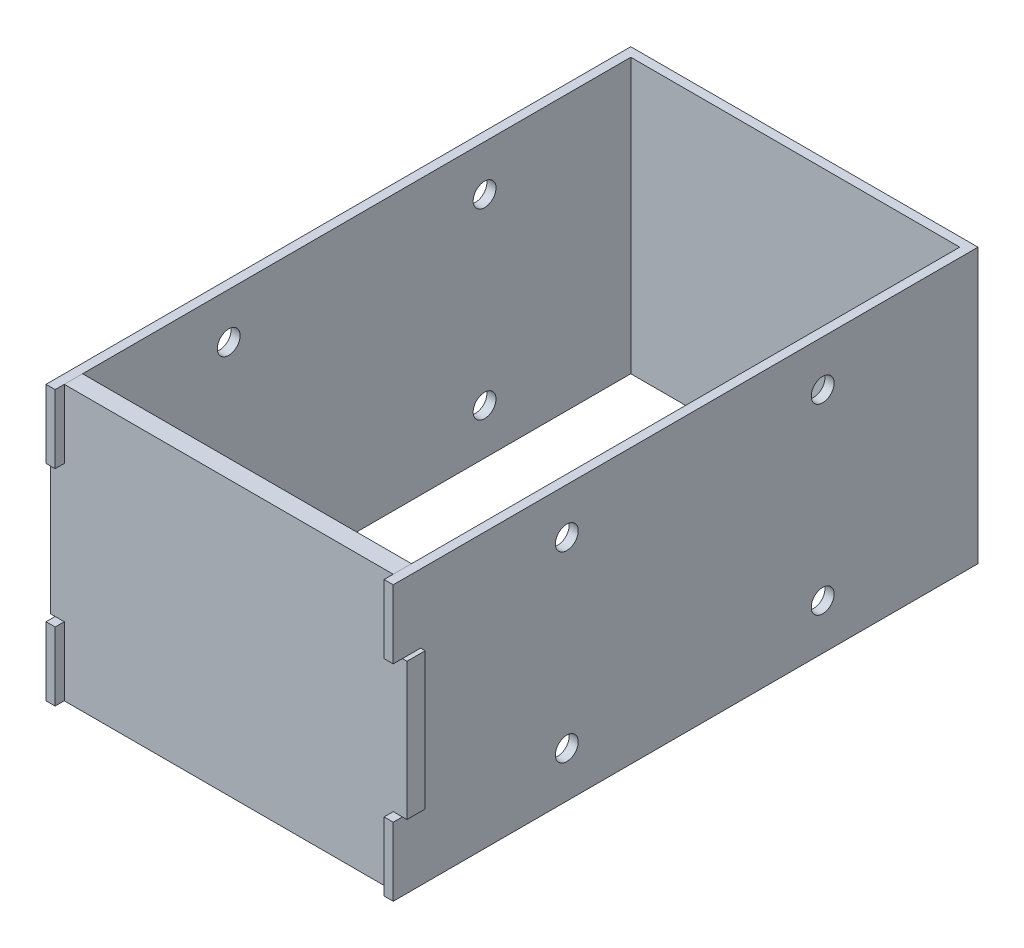
ISO-10303-21;
HEADER;
FILE_DESCRIPTION(('STEP AP214'),'2;1');
FILE_NAME('part.step','',(''),(''),'','','');
FILE_SCHEMA(('AUTOMOTIVE_DESIGN { 1 0 10303 214 1 1 1 1 }'));
ENDSEC;
DATA;
#1=APPLICATION_CONTEXT('core data for automotive mechanical design processes');
#2=APPLICATION_PROTOCOL_DEFINITION('international standard','automotive_design',2000,#1);
#3=PRODUCT_CONTEXT('',#1,'mechanical');
#4=PRODUCT('Part','Part','',(#3));
#5=PRODUCT_RELATED_PRODUCT_CATEGORY('part','',(#4));
#6=PRODUCT_DEFINITION_FORMATION('','',#4);
#7=PRODUCT_DEFINITION_CONTEXT('part definition',#1,'design');
#8=PRODUCT_DEFINITION('design','',#6,#7);
#9=PRODUCT_DEFINITION_SHAPE('','',#8);
#10=(LENGTH_UNIT() NAMED_UNIT(*) SI_UNIT(.MILLI.,.METRE.));
#11=(NAMED_UNIT(*) PLANE_ANGLE_UNIT() SI_UNIT($,.RADIAN.));
#12=(NAMED_UNIT(*) SI_UNIT($,.STERADIAN.) SOLID_ANGLE_UNIT());
#13=UNCERTAINTY_MEASURE_WITH_UNIT(LENGTH_MEASURE(1.E-05),#10,'distance_accuracy_value','');
#14=(GEOMETRIC_REPRESENTATION_CONTEXT(3) GLOBAL_UNCERTAINTY_ASSIGNED_CONTEXT((#13)) GLOBAL_UNIT_ASSIGNED_CONTEXT((#10,
#11,#12)) REPRESENTATION_CONTEXT('',''));
#15=CARTESIAN_POINT('',(0.,0.,0.));
#16=DIRECTION('',(0.,0.,1.));
#17=DIRECTION('',(1.,0.,0.));
#18=AXIS2_PLACEMENT_3D('',#15,#16,#17);
#19=CARTESIAN_POINT('',(1.,7.5,-1.));
#20=DIRECTION('',(1.,0.,0.));
#21=DIRECTION('',(0.,0.,-1.));
#22=AXIS2_PLACEMENT_3D('',#19,#20,#21);
#23=PLANE('',#22);
#24=DIRECTION('',(0.,-1.,0.));
#25=VECTOR('',#24,1.);
#26=CARTESIAN_POINT('',(1.,7.5,-3.));
#27=LINE('',#26,#25);
#28=CARTESIAN_POINT('',(1.,7.5,-3.));
#29=VERTEX_POINT('',#28);
#30=CARTESIAN_POINT('',(1.,0.,-3.));
#31=VERTEX_POINT('',#30);
#32=EDGE_CURVE('E169',#29,#31,#27,.T.);
#33=ORIENTED_EDGE('',*,*,#32,.T.);
#34=DIRECTION('',(0.,0.,-1.));
#35=VECTOR('',#34,1.);
#36=CARTESIAN_POINT('',(1.,0.,-1.));
#37=LINE('',#36,#35);
#38=CARTESIAN_POINT('',(1.,0.,-1.));
#39=VERTEX_POINT('',#38);
#40=EDGE_CURVE('E12',#39,#31,#37,.T.);
#41=ORIENTED_EDGE('',*,*,#40,.F.);
#42=DIRECTION('',(0.,-1.,0.));
#43=VECTOR('',#42,1.);
#44=CARTESIAN_POINT('',(1.,7.5,-1.));
#45=LINE('',#44,#43);
#46=CARTESIAN_POINT('',(1.,7.5,-1.));
#47=VERTEX_POINT('',#46);
#48=EDGE_CURVE('E191',#47,#39,#45,.T.);
#49=ORIENTED_EDGE('',*,*,#48,.F.);
#50=DIRECTION('',(0.,0.,-1.));
#51=VECTOR('',#50,1.);
#52=CARTESIAN_POINT('',(1.,7.5,-1.));
#53=LINE('',#52,#51);
#54=EDGE_CURVE('E165',#47,#29,#53,.T.);
#55=ORIENTED_EDGE('',*,*,#54,.T.);
#56=EDGE_LOOP('',(#33,#41,#49,#55));
#57=FACE_BOUND('',#56,.T.);
#58=ADVANCED_FACE('F49',(#57),#23,.F.);
#59=CARTESIAN_POINT('',(1.,0.,-1.));
#60=DIRECTION('',(0.,1.,0.));
#61=DIRECTION('',(0.,0.,1.));
#62=AXIS2_PLACEMENT_3D('',#59,#60,#61);
#63=PLANE('',#62);
#64=DIRECTION('',(1.,0.,0.));
#65=VECTOR('',#64,1.);
#66=CARTESIAN_POINT('',(1.,0.,-3.));
#67=LINE('',#66,#65);
#68=CARTESIAN_POINT('',(37.,0.,-3.));
#69=VERTEX_POINT('',#68);
#70=EDGE_CURVE('E172',#31,#69,#67,.T.);
#71=ORIENTED_EDGE('',*,*,#70,.T.);
#72=DIRECTION('',(0.,0.,-1.));
#73=VECTOR('',#72,1.);
#74=CARTESIAN_POINT('',(37.,0.,-1.));
#75=LINE('',#74,#73);
#76=CARTESIAN_POINT('',(37.,0.,-1.));
#77=VERTEX_POINT('',#76);
#78=EDGE_CURVE('E57',#77,#69,#75,.T.);
#79=ORIENTED_EDGE('',*,*,#78,.F.);
#80=DIRECTION('',(1.,0.,0.));
#81=VECTOR('',#80,1.);
#82=CARTESIAN_POINT('',(1.,0.,-1.));
#83=LINE('',#82,#81);
#84=EDGE_CURVE('E120',#39,#77,#83,.T.);
#85=ORIENTED_EDGE('',*,*,#84,.F.);
#86=ORIENTED_EDGE('',*,*,#40,.T.);
#87=EDGE_LOOP('',(#71,#79,#85,#86));
#88=FACE_BOUND('',#87,.T.);
#89=ADVANCED_FACE('F269',(#88),#63,.F.);
#90=CARTESIAN_POINT('',(37.,0.,-1.));
#91=DIRECTION('',(-1.,0.,0.));
#92=DIRECTION('',(0.,0.,1.));
#93=AXIS2_PLACEMENT_3D('',#90,#91,#92);
#94=PLANE('',#93);
#95=DIRECTION('',(0.,1.,0.));
#96=VECTOR('',#95,1.);
#97=CARTESIAN_POINT('',(37.,0.,-3.));
#98=LINE('',#97,#96);
#99=CARTESIAN_POINT('',(37.,7.5,-3.));
#100=VERTEX_POINT('',#99);
#101=EDGE_CURVE('E174',#69,#100,#98,.T.);
#102=ORIENTED_EDGE('',*,*,#101,.T.);
#103=DIRECTION('',(0.,0.,-1.));
#104=VECTOR('',#103,1.);
#105=CARTESIAN_POINT('',(37.,7.5,-1.));
#106=LINE('',#105,#104);
#107=CARTESIAN_POINT('',(37.,7.5,-1.));
#108=VERTEX_POINT('',#107);
#109=EDGE_CURVE('E210',#108,#100,#106,.T.);
#110=ORIENTED_EDGE('',*,*,#109,.F.);
#111=DIRECTION('',(0.,1.,0.));
#112=VECTOR('',#111,1.);
#113=CARTESIAN_POINT('',(37.,0.,-1.));
#114=LINE('',#113,#112);
#115=EDGE_CURVE('E218',#77,#108,#114,.T.);
#116=ORIENTED_EDGE('',*,*,#115,.F.);
#117=ORIENTED_EDGE('',*,*,#78,.T.);
#118=EDGE_LOOP('',(#102,#110,#116,#117));
#119=FACE_BOUND('',#118,.T.);
#120=ADVANCED_FACE('F216',(#119),#94,.F.);
#121=CARTESIAN_POINT('',(38.5,7.5,-1.));
#122=DIRECTION('',(0.,1.,0.));
#123=DIRECTION('',(-1.,0.,0.));
#124=AXIS2_PLACEMENT_3D('',#121,#122,#123);
#125=PLANE('',#124);
#126=DIRECTION('',(1.,0.,0.));
#127=VECTOR('',#126,1.);
#128=CARTESIAN_POINT('',(38.5,7.5,-3.));
#129=LINE('',#128,#127);
#130=CARTESIAN_POINT('',(38.5,7.5,-3.));
#131=VERTEX_POINT('',#130);
#132=EDGE_CURVE('E176',#100,#131,#129,.T.);
#133=ORIENTED_EDGE('',*,*,#132,.T.);
#134=DIRECTION('',(0.,0.,-1.));
#135=VECTOR('',#134,1.);
#136=CARTESIAN_POINT('',(38.5,7.5,-1.));
#137=LINE('',#136,#135);
#138=CARTESIAN_POINT('',(38.5,7.5,-1.));
#139=VERTEX_POINT('',#138);
#140=EDGE_CURVE('E207',#139,#131,#137,.T.);
#141=ORIENTED_EDGE('',*,*,#140,.F.);
#142=DIRECTION('',(1.,0.,0.));
#143=VECTOR('',#142,1.);
#144=CARTESIAN_POINT('',(38.5,7.5,-1.));
#145=LINE('',#144,#143);
#146=EDGE_CURVE('E236',#108,#139,#145,.T.);
#147=ORIENTED_EDGE('',*,*,#146,.F.);
#148=ORIENTED_EDGE('',*,*,#109,.T.);
#149=EDGE_LOOP('',(#133,#141,#147,#148));
#150=FACE_BOUND('',#149,.T.);
#151=ADVANCED_FACE('F227',(#150),#125,.F.);
#152=CARTESIAN_POINT('',(38.5,22.5,-1.));
#153=DIRECTION('',(-1.,0.,0.));
#154=DIRECTION('',(0.,0.,1.));
#155=AXIS2_PLACEMENT_3D('',#152,#153,#154);
#156=PLANE('',#155);
#157=DIRECTION('',(0.,1.,0.));
#158=VECTOR('',#157,1.);
#159=CARTESIAN_POINT('',(38.5,22.5,-3.));
#160=LINE('',#159,#158);
#161=CARTESIAN_POINT('',(38.5,22.5,-3.));
#162=VERTEX_POINT('',#161);
#163=EDGE_CURVE('E178',#131,#162,#160,.T.);
#164=ORIENTED_EDGE('',*,*,#163,.T.);
#165=DIRECTION('',(0.,0.,-1.));
#166=VECTOR('',#165,1.);
#167=CARTESIAN_POINT('',(38.5,22.5,-1.));
#168=LINE('',#167,#166);
#169=CARTESIAN_POINT('',(38.5,22.5,-1.));
#170=VERTEX_POINT('',#169);
#171=EDGE_CURVE('E204',#170,#162,#168,.T.);
#172=ORIENTED_EDGE('',*,*,#171,.F.);
#173=DIRECTION('',(0.,1.,0.));
#174=VECTOR('',#173,1.);
#175=CARTESIAN_POINT('',(38.5,22.5,-1.));
#176=LINE('',#175,#174);
#177=EDGE_CURVE('E233',#139,#170,#176,.T.);
#178=ORIENTED_EDGE('',*,*,#177,.F.);
#179=ORIENTED_EDGE('',*,*,#140,.T.);
#180=EDGE_LOOP('',(#164,#172,#178,#179));
#181=FACE_BOUND('',#180,.T.);
#182=ADVANCED_FACE('F231',(#181),#156,.F.);
#183=CARTESIAN_POINT('',(37.,22.5,-1.));
#184=DIRECTION('',(0.,-1.,0.));
#185=DIRECTION('',(1.,0.,0.));
#186=AXIS2_PLACEMENT_3D('',#183,#184,#185);
#187=PLANE('',#186);
#188=DIRECTION('',(-1.,0.,0.));
#189=VECTOR('',#188,1.);
#190=CARTESIAN_POINT('',(37.,22.5,-3.));
#191=LINE('',#190,#189);
#192=CARTESIAN_POINT('',(37.,22.5,-3.));
#193=VERTEX_POINT('',#192);
#194=EDGE_CURVE('E180',#162,#193,#191,.T.);
#195=ORIENTED_EDGE('',*,*,#194,.T.);
#196=DIRECTION('',(0.,0.,-1.));
#197=VECTOR('',#196,1.);
#198=CARTESIAN_POINT('',(37.,22.5,-1.));
#199=LINE('',#198,#197);
#200=CARTESIAN_POINT('',(37.,22.5,-1.));
#201=VERTEX_POINT('',#200);
#202=EDGE_CURVE('E201',#201,#193,#199,.T.);
#203=ORIENTED_EDGE('',*,*,#202,.F.);
#204=DIRECTION('',(-1.,0.,0.));
#205=VECTOR('',#204,1.);
#206=CARTESIAN_POINT('',(37.,22.5,-1.));
#207=LINE('',#206,#205);
#208=EDGE_CURVE('E235',#170,#201,#207,.T.);
#209=ORIENTED_EDGE('',*,*,#208,.F.);
#210=ORIENTED_EDGE('',*,*,#171,.T.);
#211=EDGE_LOOP('',(#195,#203,#209,#210));
#212=FACE_BOUND('',#211,.T.);
#213=ADVANCED_FACE('F282',(#212),#187,.F.);
#214=CARTESIAN_POINT('',(37.,22.5,-1.));
#215=DIRECTION('',(-1.,0.,0.));
#216=DIRECTION('',(0.,0.,1.));
#217=AXIS2_PLACEMENT_3D('',#214,#215,#216);
#218=PLANE('',#217);
#219=DIRECTION('',(0.,1.,0.));
#220=VECTOR('',#219,1.);
#221=CARTESIAN_POINT('',(37.,22.5,-3.));
#222=LINE('',#221,#220);
#223=CARTESIAN_POINT('',(37.,30.,-3.));
#224=VERTEX_POINT('',#223);
#225=EDGE_CURVE('E182',#193,#224,#222,.T.);
#226=ORIENTED_EDGE('',*,*,#225,.T.);
#227=DIRECTION('',(0.,0.,-1.));
#228=VECTOR('',#227,1.);
#229=CARTESIAN_POINT('',(37.,30.,-1.));
#230=LINE('',#229,#228);
#231=CARTESIAN_POINT('',(37.,30.,-1.));
#232=VERTEX_POINT('',#231);
#233=EDGE_CURVE('E198',#232,#224,#230,.T.);
#234=ORIENTED_EDGE('',*,*,#233,.F.);
#235=DIRECTION('',(0.,1.,0.));
#236=VECTOR('',#235,1.);
#237=CARTESIAN_POINT('',(37.,22.5,-1.));
#238=LINE('',#237,#236);
#239=EDGE_CURVE('E238',#201,#232,#238,.T.);
#240=ORIENTED_EDGE('',*,*,#239,.F.);
#241=ORIENTED_EDGE('',*,*,#202,.T.);
#242=EDGE_LOOP('',(#226,#234,#240,#241));
#243=FACE_BOUND('',#242,.T.);
#244=ADVANCED_FACE('F285',(#243),#218,.F.);
#245=CARTESIAN_POINT('',(37.,30.,-1.));
#246=DIRECTION('',(0.,-1.,0.));
#247=DIRECTION('',(0.,0.,-1.));
#248=AXIS2_PLACEMENT_3D('',#245,#246,#247);
#249=PLANE('',#248);
#250=DIRECTION('',(-1.,0.,0.));
#251=VECTOR('',#250,1.);
#252=CARTESIAN_POINT('',(37.,30.,-3.));
#253=LINE('',#252,#251);
#254=CARTESIAN_POINT('',(1.,30.,-3.));
#255=VERTEX_POINT('',#254);
#256=EDGE_CURVE('E184',#224,#255,#253,.T.);
#257=ORIENTED_EDGE('',*,*,#256,.T.);
#258=DIRECTION('',(0.,0.,-1.));
#259=VECTOR('',#258,1.);
#260=CARTESIAN_POINT('',(1.,30.,-1.));
#261=LINE('',#260,#259);
#262=CARTESIAN_POINT('',(1.,30.,-1.));
#263=VERTEX_POINT('',#262);
#264=EDGE_CURVE('E195',#263,#255,#261,.T.);
#265=ORIENTED_EDGE('',*,*,#264,.F.);
#266=DIRECTION('',(-1.,0.,0.));
#267=VECTOR('',#266,1.);
#268=CARTESIAN_POINT('',(37.,30.,-1.));
#269=LINE('',#268,#267);
#270=EDGE_CURVE('E244',#232,#263,#269,.T.);
#271=ORIENTED_EDGE('',*,*,#270,.F.);
#272=ORIENTED_EDGE('',*,*,#233,.T.);
#273=EDGE_LOOP('',(#257,#265,#271,#272));
#274=FACE_BOUND('',#273,.T.);
#275=ADVANCED_FACE('F250',(#274),#249,.F.);
#276=CARTESIAN_POINT('',(1.,30.,-1.));
#277=DIRECTION('',(1.,0.,0.));
#278=DIRECTION('',(0.,1.,0.));
#279=AXIS2_PLACEMENT_3D('',#276,#277,#278);
#280=PLANE('',#279);
#281=DIRECTION('',(0.,-1.,0.));
#282=VECTOR('',#281,1.);
#283=CARTESIAN_POINT('',(1.,30.,-3.));
#284=LINE('',#283,#282);
#285=CARTESIAN_POINT('',(1.,22.5,-3.));
#286=VERTEX_POINT('',#285);
#287=EDGE_CURVE('E186',#255,#286,#284,.T.);
#288=ORIENTED_EDGE('',*,*,#287,.T.);
#289=DIRECTION('',(0.,0.,-1.));
#290=VECTOR('',#289,1.);
#291=CARTESIAN_POINT('',(1.,22.5,-1.));
#292=LINE('',#291,#290);
#293=CARTESIAN_POINT('',(1.,22.5,-1.));
#294=VERTEX_POINT('',#293);
#295=EDGE_CURVE('E160',#294,#286,#292,.T.);
#296=ORIENTED_EDGE('',*,*,#295,.F.);
#297=DIRECTION('',(0.,-1.,0.));
#298=VECTOR('',#297,1.);
#299=CARTESIAN_POINT('',(1.,30.,-1.));
#300=LINE('',#299,#298);
#301=EDGE_CURVE('E151',#263,#294,#300,.T.);
#302=ORIENTED_EDGE('',*,*,#301,.F.);
#303=ORIENTED_EDGE('',*,*,#264,.T.);
#304=EDGE_LOOP('',(#288,#296,#302,#303));
#305=FACE_BOUND('',#304,.T.);
#306=ADVANCED_FACE('F254',(#305),#280,.F.);
#307=CARTESIAN_POINT('',(1.,22.5,-1.));
#308=DIRECTION('',(0.,-1.,0.));
#309=DIRECTION('',(0.,0.,-1.));
#310=AXIS2_PLACEMENT_3D('',#307,#308,#309);
#311=PLANE('',#310);
#312=DIRECTION('',(-1.,0.,0.));
#313=VECTOR('',#312,1.);
#314=CARTESIAN_POINT('',(1.,22.5,-3.));
#315=LINE('',#314,#313);
#316=CARTESIAN_POINT('',(-0.499999999999999,22.5,-3.));
#317=VERTEX_POINT('',#316);
#318=EDGE_CURVE('E159',#286,#317,#315,.T.);
#319=ORIENTED_EDGE('',*,*,#318,.T.);
#320=DIRECTION('',(0.,0.,-1.));
#321=VECTOR('',#320,1.);
#322=CARTESIAN_POINT('',(-0.499999999999999,22.5,-1.));
#323=LINE('',#322,#321);
#324=CARTESIAN_POINT('',(-0.499999999999999,22.5,-1.));
#325=VERTEX_POINT('',#324);
#326=EDGE_CURVE('E156',#325,#317,#323,.T.);
#327=ORIENTED_EDGE('',*,*,#326,.F.);
#328=DIRECTION('',(-1.,0.,0.));
#329=VECTOR('',#328,1.);
#330=CARTESIAN_POINT('',(1.,22.5,-1.));
#331=LINE('',#330,#329);
#332=EDGE_CURVE('E145',#294,#325,#331,.T.);
#333=ORIENTED_EDGE('',*,*,#332,.F.);
#334=ORIENTED_EDGE('',*,*,#295,.T.);
#335=EDGE_LOOP('',(#319,#327,#333,#334));
#336=FACE_BOUND('',#335,.T.);
#337=ADVANCED_FACE('F157',(#336),#311,.F.);
#338=CARTESIAN_POINT('',(-0.499999999999999,22.5,-1.));
#339=DIRECTION('',(1.,0.,0.));
#340=DIRECTION('',(0.,1.,0.));
#341=AXIS2_PLACEMENT_3D('',#338,#339,#340);
#342=PLANE('',#341);
#343=DIRECTION('',(0.,-1.,0.));
#344=VECTOR('',#343,1.);
#345=CARTESIAN_POINT('',(-0.499999999999999,22.5,-3.));
#346=LINE('',#345,#344);
#347=CARTESIAN_POINT('',(-0.499999999999997,7.5,-3.));
#348=VERTEX_POINT('',#347);
#349=EDGE_CURVE('E106',#317,#348,#346,.T.);
#350=ORIENTED_EDGE('',*,*,#349,.T.);
#351=DIRECTION('',(0.,0.,-1.));
#352=VECTOR('',#351,1.);
#353=CARTESIAN_POINT('',(-0.499999999999997,7.5,-1.));
#354=LINE('',#353,#352);
#355=CARTESIAN_POINT('',(-0.499999999999997,7.5,-1.));
#356=VERTEX_POINT('',#355);
#357=EDGE_CURVE('E161',#356,#348,#354,.T.);
#358=ORIENTED_EDGE('',*,*,#357,.F.);
#359=DIRECTION('',(0.,-1.,0.));
#360=VECTOR('',#359,1.);
#361=CARTESIAN_POINT('',(-0.499999999999999,22.5,-1.));
#362=LINE('',#361,#360);
#363=EDGE_CURVE('E149',#325,#356,#362,.T.);
#364=ORIENTED_EDGE('',*,*,#363,.F.);
#365=ORIENTED_EDGE('',*,*,#326,.T.);
#366=EDGE_LOOP('',(#350,#358,#364,#365));
#367=FACE_BOUND('',#366,.T.);
#368=ADVANCED_FACE('F163',(#367),#342,.F.);
#369=CARTESIAN_POINT('',(-0.499999999999997,7.5,-1.));
#370=DIRECTION('',(0.,1.,0.));
#371=DIRECTION('',(0.,0.,1.));
#372=AXIS2_PLACEMENT_3D('',#369,#370,#371);
#373=PLANE('',#372);
#374=DIRECTION('',(1.,0.,0.));
#375=VECTOR('',#374,1.);
#376=CARTESIAN_POINT('',(-0.499999999999997,7.5,-3.));
#377=LINE('',#376,#375);
#378=EDGE_CURVE('E112',#348,#29,#377,.T.);
#379=ORIENTED_EDGE('',*,*,#378,.T.);
#380=ORIENTED_EDGE('',*,*,#54,.F.);
#381=DIRECTION('',(1.,0.,0.));
#382=VECTOR('',#381,1.);
#383=CARTESIAN_POINT('',(-0.499999999999997,7.5,-1.));
#384=LINE('',#383,#382);
#385=EDGE_CURVE('E65',#356,#47,#384,.T.);
#386=ORIENTED_EDGE('',*,*,#385,.F.);
#387=ORIENTED_EDGE('',*,*,#357,.T.);
#388=EDGE_LOOP('',(#379,#380,#386,#387));
#389=FACE_BOUND('',#388,.T.);
#390=ADVANCED_FACE('F258',(#389),#373,.F.);
#391=CARTESIAN_POINT('',(0.,0.,-1.));
#392=DIRECTION('',(0.,0.,1.));
#393=DIRECTION('',(1.,0.,0.));
#394=AXIS2_PLACEMENT_3D('',#391,#392,#393);
#395=PLANE('',#394);
#396=ORIENTED_EDGE('',*,*,#48,.T.);
#397=ORIENTED_EDGE('',*,*,#84,.T.);
#398=ORIENTED_EDGE('',*,*,#115,.T.);
#399=ORIENTED_EDGE('',*,*,#146,.T.);
#400=ORIENTED_EDGE('',*,*,#177,.T.);
#401=ORIENTED_EDGE('',*,*,#208,.T.);
#402=ORIENTED_EDGE('',*,*,#239,.T.);
#403=ORIENTED_EDGE('',*,*,#270,.T.);
#404=ORIENTED_EDGE('',*,*,#301,.T.);
#405=ORIENTED_EDGE('',*,*,#332,.T.);
#406=ORIENTED_EDGE('',*,*,#363,.T.);
#407=ORIENTED_EDGE('',*,*,#385,.T.);
#408=EDGE_LOOP('',(#396,#397,#398,#399,#400,#401,#402,#403,#404,#405,#406,#407));
#409=FACE_BOUND('',#408,.T.);
#410=ADVANCED_FACE('F147',(#409),#395,.T.);
#411=CARTESIAN_POINT('',(0.,0.,-3.));
#412=DIRECTION('',(0.,0.,1.));
#413=DIRECTION('',(1.,0.,0.));
#414=AXIS2_PLACEMENT_3D('',#411,#412,#413);
#415=PLANE('',#414);
#416=ORIENTED_EDGE('',*,*,#32,.F.);
#417=ORIENTED_EDGE('',*,*,#378,.F.);
#418=ORIENTED_EDGE('',*,*,#349,.F.);
#419=ORIENTED_EDGE('',*,*,#318,.F.);
#420=ORIENTED_EDGE('',*,*,#287,.F.);
#421=ORIENTED_EDGE('',*,*,#256,.F.);
#422=ORIENTED_EDGE('',*,*,#225,.F.);
#423=ORIENTED_EDGE('',*,*,#194,.F.);
#424=ORIENTED_EDGE('',*,*,#163,.F.);
#425=ORIENTED_EDGE('',*,*,#132,.F.);
#426=ORIENTED_EDGE('',*,*,#101,.F.);
#427=ORIENTED_EDGE('',*,*,#70,.F.);
#428=EDGE_LOOP('',(#416,#417,#418,#419,#420,#421,#422,#423,#424,#425,#426,#427));
#429=FACE_BOUND('',#428,.T.);
#430=ADVANCED_FACE('F222',(#429),#415,.F.);
#431=CLOSED_SHELL('',(#58,#89,#120,#151,#182,#213,#244,#275,#306,#337,#368,#390,#410,#430));
#432=MANIFOLD_SOLID_BREP('B2',#431);
#433=CARTESIAN_POINT('',(0.,30.,0.));
#434=DIRECTION('',(0.,0.,-1.));
#435=DIRECTION('',(-1.,0.,0.));
#436=AXIS2_PLACEMENT_3D('',#433,#434,#435);
#437=PLANE('',#436);
#438=DIRECTION('',(0.,-1.,0.));
#439=VECTOR('',#438,1.);
#440=CARTESIAN_POINT('',(1.,30.,0.));
#441=LINE('',#440,#439);
#442=CARTESIAN_POINT('',(1.,7.5,0.));
#443=VERTEX_POINT('',#442);
#444=CARTESIAN_POINT('',(1.,0.,0.));
#445=VERTEX_POINT('',#444);
#446=EDGE_CURVE('E644',#443,#445,#441,.T.);
#447=ORIENTED_EDGE('',*,*,#446,.F.);
#448=DIRECTION('',(1.,0.,0.));
#449=VECTOR('',#448,1.);
#450=CARTESIAN_POINT('',(38.,7.5,0.));
#451=LINE('',#450,#449);
#452=CARTESIAN_POINT('',(0.,7.5,0.));
#453=VERTEX_POINT('',#452);
#454=EDGE_CURVE('E508',#453,#443,#451,.T.);
#455=ORIENTED_EDGE('',*,*,#454,.F.);
#456=DIRECTION('',(0.,-1.,0.));
#457=VECTOR('',#456,1.);
#458=CARTESIAN_POINT('',(0.,30.,0.));
#459=LINE('',#458,#457);
#460=CARTESIAN_POINT('',(0.,0.,0.));
#461=VERTEX_POINT('',#460);
#462=EDGE_CURVE('E604',#453,#461,#459,.T.);
#463=ORIENTED_EDGE('',*,*,#462,.T.);
#464=DIRECTION('',(1.,0.,0.));
#465=VECTOR('',#464,1.);
#466=CARTESIAN_POINT('',(0.,0.,0.));
#467=LINE('',#466,#465);
#468=EDGE_CURVE('E585',#461,#445,#467,.T.);
#469=ORIENTED_EDGE('',*,*,#468,.T.);
#470=EDGE_LOOP('',(#447,#455,#463,#469));
#471=FACE_BOUND('',#470,.T.);
#472=ADVANCED_FACE('F380',(#471),#437,.F.);
#473=CARTESIAN_POINT('',(38.,30.,0.));
#474=DIRECTION('',(0.,0.,-1.));
#475=DIRECTION('',(-1.,0.,0.));
#476=AXIS2_PLACEMENT_3D('',#473,#474,#475);
#477=PLANE('',#476);
#478=DIRECTION('',(0.,-1.,0.));
#479=VECTOR('',#478,1.);
#480=CARTESIAN_POINT('',(38.,30.,0.));
#481=LINE('',#480,#479);
#482=CARTESIAN_POINT('',(38.,7.5,0.));
#483=VERTEX_POINT('',#482);
#484=CARTESIAN_POINT('',(38.,0.,0.));
#485=VERTEX_POINT('',#484);
#486=EDGE_CURVE('E632',#483,#485,#481,.T.);
#487=ORIENTED_EDGE('',*,*,#486,.F.);
#488=DIRECTION('',(-1.,0.,0.));
#489=VECTOR('',#488,1.);
#490=CARTESIAN_POINT('',(38.,7.5,0.));
#491=LINE('',#490,#489);
#492=CARTESIAN_POINT('',(37.,7.5,0.));
#493=VERTEX_POINT('',#492);
#494=EDGE_CURVE('E388',#483,#493,#491,.T.);
#495=ORIENTED_EDGE('',*,*,#494,.T.);
#496=DIRECTION('',(0.,-1.,0.));
#497=VECTOR('',#496,1.);
#498=CARTESIAN_POINT('',(37.,30.,0.));
#499=LINE('',#498,#497);
#500=CARTESIAN_POINT('',(37.,0.,0.));
#501=VERTEX_POINT('',#500);
#502=EDGE_CURVE('E634',#493,#501,#499,.T.);
#503=ORIENTED_EDGE('',*,*,#502,.T.);
#504=DIRECTION('',(1.,0.,0.));
#505=VECTOR('',#504,1.);
#506=CARTESIAN_POINT('',(38.,0.,0.));
#507=LINE('',#506,#505);
#508=EDGE_CURVE('E614',#501,#485,#507,.T.);
#509=ORIENTED_EDGE('',*,*,#508,.T.);
#510=EDGE_LOOP('',(#487,#495,#503,#509));
#511=FACE_BOUND('',#510,.T.);
#512=ADVANCED_FACE('F651',(#511),#477,.F.);
#513=CARTESIAN_POINT('',(38.,30.,-64.));
#514=DIRECTION('',(-1.,0.,0.));
#515=DIRECTION('',(0.,0.,1.));
#516=AXIS2_PLACEMENT_3D('',#513,#514,#515);
#517=PLANE('',#516);
#518=CARTESIAN_POINT('',(38.,5.,-47.));
#519=DIRECTION('',(1.,0.,0.));
#520=DIRECTION('',(0.,0.,-1.));
#521=AXIS2_PLACEMENT_3D('',#518,#519,#520);
#522=CIRCLE('',#521,1.25);
#523=CARTESIAN_POINT('',(38.,5.,-48.25));
#524=VERTEX_POINT('',#523);
#525=EDGE_CURVE('E537',#524,#524,#522,.T.);
#526=ORIENTED_EDGE('',*,*,#525,.F.);
#527=EDGE_LOOP('',(#526));
#528=FACE_BOUND('',#527,.T.);
#529=DIRECTION('',(0.,1.,0.));
#530=VECTOR('',#529,1.);
#531=CARTESIAN_POINT('',(38.,7.5,-3.));
#532=LINE('',#531,#530);
#533=CARTESIAN_POINT('',(38.,7.5,-3.));
#534=VERTEX_POINT('',#533);
#535=CARTESIAN_POINT('',(38.,22.5,-3.));
#536=VERTEX_POINT('',#535);
#537=EDGE_CURVE('E501',#534,#536,#532,.T.);
#538=ORIENTED_EDGE('',*,*,#537,.F.);
#539=DIRECTION('',(0.,0.,1.));
#540=VECTOR('',#539,1.);
#541=CARTESIAN_POINT('',(38.,7.5,-3.));
#542=LINE('',#541,#540);
#543=EDGE_CURVE('E526',#534,#483,#542,.T.);
#544=ORIENTED_EDGE('',*,*,#543,.T.);
#545=ORIENTED_EDGE('',*,*,#486,.T.);
#546=DIRECTION('',(0.,0.,-1.));
#547=VECTOR('',#546,1.);
#548=CARTESIAN_POINT('',(38.,0.,-64.));
#549=LINE('',#548,#547);
#550=CARTESIAN_POINT('',(38.,0.,-64.));
#551=VERTEX_POINT('',#550);
#552=EDGE_CURVE('E617',#485,#551,#549,.T.);
#553=ORIENTED_EDGE('',*,*,#552,.T.);
#554=DIRECTION('',(0.,-1.,0.));
#555=VECTOR('',#554,1.);
#556=CARTESIAN_POINT('',(38.,30.,-64.));
#557=LINE('',#556,#555);
#558=CARTESIAN_POINT('',(38.,30.,-64.));
#559=VERTEX_POINT('',#558);
#560=EDGE_CURVE('E629',#559,#551,#557,.T.);
#561=ORIENTED_EDGE('',*,*,#560,.F.);
#562=DIRECTION('',(0.,0.,-1.));
#563=VECTOR('',#562,1.);
#564=CARTESIAN_POINT('',(38.,30.,-64.));
#565=LINE('',#564,#563);
#566=CARTESIAN_POINT('',(38.,30.,0.));
#567=VERTEX_POINT('',#566);
#568=EDGE_CURVE('E598',#567,#559,#565,.T.);
#569=ORIENTED_EDGE('',*,*,#568,.F.);
#570=CARTESIAN_POINT('',(38.,22.5,0.));
#571=VERTEX_POINT('',#570);
#572=EDGE_CURVE('E515',#567,#571,#481,.T.);
#573=ORIENTED_EDGE('',*,*,#572,.T.);
#574=DIRECTION('',(0.,0.,1.));
#575=VECTOR('',#574,1.);
#576=CARTESIAN_POINT('',(38.,22.5,-3.));
#577=LINE('',#576,#575);
#578=EDGE_CURVE('E403',#536,#571,#577,.T.);
#579=ORIENTED_EDGE('',*,*,#578,.F.);
#580=EDGE_LOOP('',(#538,#544,#545,#553,#561,#569,#573,#579));
#581=FACE_BOUND('',#580,.T.);
#582=CARTESIAN_POINT('',(38.,5.,-19.));
#583=DIRECTION('',(1.,0.,0.));
#584=DIRECTION('',(0.,0.,-1.));
#585=AXIS2_PLACEMENT_3D('',#582,#583,#584);
#586=CIRCLE('',#585,1.25);
#587=CARTESIAN_POINT('',(38.,5.,-20.25));
#588=VERTEX_POINT('',#587);
#589=EDGE_CURVE('E555',#588,#588,#586,.T.);
#590=ORIENTED_EDGE('',*,*,#589,.F.);
#591=EDGE_LOOP('',(#590));
#592=FACE_BOUND('',#591,.T.);
#593=CARTESIAN_POINT('',(38.,25.,-19.));
#594=DIRECTION('',(1.,0.,0.));
#595=DIRECTION('',(0.,0.,-1.));
#596=AXIS2_PLACEMENT_3D('',#593,#594,#595);
#597=CIRCLE('',#596,1.25);
#598=CARTESIAN_POINT('',(38.,25.,-20.25));
#599=VERTEX_POINT('',#598);
#600=EDGE_CURVE('E549',#599,#599,#597,.T.);
#601=ORIENTED_EDGE('',*,*,#600,.F.);
#602=EDGE_LOOP('',(#601));
#603=FACE_BOUND('',#602,.T.);
#604=CARTESIAN_POINT('',(38.,25.,-47.));
#605=DIRECTION('',(1.,0.,0.));
#606=DIRECTION('',(0.,0.,-1.));
#607=AXIS2_PLACEMENT_3D('',#604,#605,#606);
#608=CIRCLE('',#607,1.25);
#609=CARTESIAN_POINT('',(38.,25.,-48.25));
#610=VERTEX_POINT('',#609);
#611=EDGE_CURVE('E543',#610,#610,#608,.T.);
#612=ORIENTED_EDGE('',*,*,#611,.F.);
#613=EDGE_LOOP('',(#612));
#614=FACE_BOUND('',#613,.T.);
#615=ADVANCED_FACE('F511',(#528,#581,#592,#603,#614),#517,.F.);
#616=CARTESIAN_POINT('',(0.,30.,0.));
#617=DIRECTION('',(1.,0.,0.));
#618=DIRECTION('',(0.,0.,-1.));
#619=AXIS2_PLACEMENT_3D('',#616,#617,#618);
#620=PLANE('',#619);
#621=ORIENTED_EDGE('',*,*,#462,.F.);
#622=DIRECTION('',(0.,0.,1.));
#623=VECTOR('',#622,1.);
#624=CARTESIAN_POINT('',(0.,7.5,-3.));
#625=LINE('',#624,#623);
#626=CARTESIAN_POINT('',(0.,7.5,-3.));
#627=VERTEX_POINT('',#626);
#628=EDGE_CURVE('E519',#627,#453,#625,.T.);
#629=ORIENTED_EDGE('',*,*,#628,.F.);
#630=DIRECTION('',(0.,-1.,0.));
#631=VECTOR('',#630,1.);
#632=CARTESIAN_POINT('',(0.,7.5,-3.));
#633=LINE('',#632,#631);
#634=CARTESIAN_POINT('',(0.,22.5,-3.));
#635=VERTEX_POINT('',#634);
#636=EDGE_CURVE('E497',#635,#627,#633,.T.);
#637=ORIENTED_EDGE('',*,*,#636,.F.);
#638=DIRECTION('',(0.,0.,1.));
#639=VECTOR('',#638,1.);
#640=CARTESIAN_POINT('',(0.,22.5,-3.));
#641=LINE('',#640,#639);
#642=CARTESIAN_POINT('',(0.,22.5,0.));
#643=VERTEX_POINT('',#642);
#644=EDGE_CURVE('E516',#635,#643,#641,.T.);
#645=ORIENTED_EDGE('',*,*,#644,.T.);
#646=CARTESIAN_POINT('',(0.,30.,0.));
#647=VERTEX_POINT('',#646);
#648=EDGE_CURVE('E623',#647,#643,#459,.T.);
#649=ORIENTED_EDGE('',*,*,#648,.F.);
#650=DIRECTION('',(0.,0.,1.));
#651=VECTOR('',#650,1.);
#652=CARTESIAN_POINT('',(0.,30.,0.));
#653=LINE('',#652,#651);
#654=CARTESIAN_POINT('',(0.,30.,-64.));
#655=VERTEX_POINT('',#654);
#656=EDGE_CURVE('E602',#655,#647,#653,.T.);
#657=ORIENTED_EDGE('',*,*,#656,.F.);
#658=DIRECTION('',(0.,-1.,0.));
#659=VECTOR('',#658,1.);
#660=CARTESIAN_POINT('',(0.,30.,-64.));
#661=LINE('',#660,#659);
#662=CARTESIAN_POINT('',(0.,0.,-64.));
#663=VERTEX_POINT('',#662);
#664=EDGE_CURVE('E626',#655,#663,#661,.T.);
#665=ORIENTED_EDGE('',*,*,#664,.T.);
#666=DIRECTION('',(0.,0.,1.));
#667=VECTOR('',#666,1.);
#668=CARTESIAN_POINT('',(0.,0.,0.));
#669=LINE('',#668,#667);
#670=EDGE_CURVE('E590',#663,#461,#669,.T.);
#671=ORIENTED_EDGE('',*,*,#670,.T.);
#672=EDGE_LOOP('',(#621,#629,#637,#645,#649,#657,#665,#671));
#673=FACE_BOUND('',#672,.T.);
#674=CARTESIAN_POINT('',(0.,5.,-47.));
#675=DIRECTION('',(-1.,0.,0.));
#676=DIRECTION('',(0.,0.,1.));
#677=AXIS2_PLACEMENT_3D('',#674,#675,#676);
#678=CIRCLE('',#677,1.25);
#679=CARTESIAN_POINT('',(0.,5.,-45.75));
#680=VERTEX_POINT('',#679);
#681=EDGE_CURVE('E561',#680,#680,#678,.T.);
#682=ORIENTED_EDGE('',*,*,#681,.F.);
#683=EDGE_LOOP('',(#682));
#684=FACE_BOUND('',#683,.T.);
#685=CARTESIAN_POINT('',(0.,25.,-47.));
#686=DIRECTION('',(-1.,0.,0.));
#687=DIRECTION('',(0.,0.,1.));
#688=AXIS2_PLACEMENT_3D('',#685,#686,#687);
#689=CIRCLE('',#688,1.25);
#690=CARTESIAN_POINT('',(0.,25.,-45.75));
#691=VERTEX_POINT('',#690);
#692=EDGE_CURVE('E567',#691,#691,#689,.T.);
#693=ORIENTED_EDGE('',*,*,#692,.F.);
#694=EDGE_LOOP('',(#693));
#695=FACE_BOUND('',#694,.T.);
#696=CARTESIAN_POINT('',(0.,25.,-19.));
#697=DIRECTION('',(-1.,0.,0.));
#698=DIRECTION('',(0.,0.,1.));
#699=AXIS2_PLACEMENT_3D('',#696,#697,#698);
#700=CIRCLE('',#699,1.25);
#701=CARTESIAN_POINT('',(0.,25.,-17.75));
#702=VERTEX_POINT('',#701);
#703=EDGE_CURVE('E573',#702,#702,#700,.T.);
#704=ORIENTED_EDGE('',*,*,#703,.F.);
#705=EDGE_LOOP('',(#704));
#706=FACE_BOUND('',#705,.T.);
#707=CARTESIAN_POINT('',(0.,5.,-19.));
#708=DIRECTION('',(-1.,0.,0.));
#709=DIRECTION('',(0.,0.,1.));
#710=AXIS2_PLACEMENT_3D('',#707,#708,#709);
#711=CIRCLE('',#710,1.25);
#712=CARTESIAN_POINT('',(0.,5.,-17.75));
#713=VERTEX_POINT('',#712);
#714=EDGE_CURVE('E579',#713,#713,#711,.T.);
#715=ORIENTED_EDGE('',*,*,#714,.F.);
#716=EDGE_LOOP('',(#715));
#717=FACE_BOUND('',#716,.T.);
#718=ADVANCED_FACE('F695',(#673,#684,#695,#706,#717),#620,.F.);
#719=ORIENTED_EDGE('',*,*,#648,.T.);
#720=DIRECTION('',(-1.,0.,0.));
#721=VECTOR('',#720,1.);
#722=CARTESIAN_POINT('',(38.,22.5,0.));
#723=LINE('',#722,#721);
#724=CARTESIAN_POINT('',(1.,22.5,0.));
#725=VERTEX_POINT('',#724);
#726=EDGE_CURVE('E681',#725,#643,#723,.T.);
#727=ORIENTED_EDGE('',*,*,#726,.F.);
#728=CARTESIAN_POINT('',(1.,30.,0.));
#729=VERTEX_POINT('',#728);
#730=EDGE_CURVE('E645',#729,#725,#441,.T.);
#731=ORIENTED_EDGE('',*,*,#730,.F.);
#732=DIRECTION('',(1.,0.,0.));
#733=VECTOR('',#732,1.);
#734=CARTESIAN_POINT('',(0.,30.,0.));
#735=LINE('',#734,#733);
#736=EDGE_CURVE('E586',#647,#729,#735,.T.);
#737=ORIENTED_EDGE('',*,*,#736,.F.);
#738=EDGE_LOOP('',(#719,#727,#731,#737));
#739=FACE_BOUND('',#738,.T.);
#740=ADVANCED_FACE('F382',(#739),#437,.F.);
#741=CARTESIAN_POINT('',(1.,30.,0.));
#742=DIRECTION('',(-1.,0.,0.));
#743=DIRECTION('',(0.,0.,1.));
#744=AXIS2_PLACEMENT_3D('',#741,#742,#743);
#745=PLANE('',#744);
#746=CARTESIAN_POINT('',(1.,5.,-47.));
#747=DIRECTION('',(-1.,0.,0.));
#748=DIRECTION('',(0.,0.,1.));
#749=AXIS2_PLACEMENT_3D('',#746,#747,#748);
#750=CIRCLE('',#749,1.25);
#751=CARTESIAN_POINT('',(1.,5.,-45.75));
#752=VERTEX_POINT('',#751);
#753=EDGE_CURVE('E564',#752,#752,#750,.T.);
#754=ORIENTED_EDGE('',*,*,#753,.T.);
#755=EDGE_LOOP('',(#754));
#756=FACE_BOUND('',#755,.T.);
#757=CARTESIAN_POINT('',(1.,25.,-47.));
#758=DIRECTION('',(-1.,0.,0.));
#759=DIRECTION('',(0.,0.,1.));
#760=AXIS2_PLACEMENT_3D('',#757,#758,#759);
#761=CIRCLE('',#760,1.25);
#762=CARTESIAN_POINT('',(1.,25.,-45.75));
#763=VERTEX_POINT('',#762);
#764=EDGE_CURVE('E570',#763,#763,#761,.T.);
#765=ORIENTED_EDGE('',*,*,#764,.T.);
#766=EDGE_LOOP('',(#765));
#767=FACE_BOUND('',#766,.T.);
#768=CARTESIAN_POINT('',(1.,25.,-19.));
#769=DIRECTION('',(-1.,0.,0.));
#770=DIRECTION('',(0.,0.,1.));
#771=AXIS2_PLACEMENT_3D('',#768,#769,#770);
#772=CIRCLE('',#771,1.25);
#773=CARTESIAN_POINT('',(1.,25.,-17.75));
#774=VERTEX_POINT('',#773);
#775=EDGE_CURVE('E576',#774,#774,#772,.T.);
#776=ORIENTED_EDGE('',*,*,#775,.T.);
#777=EDGE_LOOP('',(#776));
#778=FACE_BOUND('',#777,.T.);
#779=CARTESIAN_POINT('',(1.,5.,-19.));
#780=DIRECTION('',(-1.,0.,0.));
#781=DIRECTION('',(0.,0.,1.));
#782=AXIS2_PLACEMENT_3D('',#779,#780,#781);
#783=CIRCLE('',#782,1.25);
#784=CARTESIAN_POINT('',(1.,5.,-17.75));
#785=VERTEX_POINT('',#784);
#786=EDGE_CURVE('E582',#785,#785,#783,.T.);
#787=ORIENTED_EDGE('',*,*,#786,.T.);
#788=EDGE_LOOP('',(#787));
#789=FACE_BOUND('',#788,.T.);
#790=DIRECTION('',(0.,1.,0.));
#791=VECTOR('',#790,1.);
#792=CARTESIAN_POINT('',(1.,30.,-3.));
#793=LINE('',#792,#791);
#794=CARTESIAN_POINT('',(1.,7.5,-3.));
#795=VERTEX_POINT('',#794);
#796=CARTESIAN_POINT('',(1.,22.5,-3.));
#797=VERTEX_POINT('',#796);
#798=EDGE_CURVE('E535',#795,#797,#793,.T.);
#799=ORIENTED_EDGE('',*,*,#798,.F.);
#800=DIRECTION('',(0.,0.,1.));
#801=VECTOR('',#800,1.);
#802=CARTESIAN_POINT('',(1.,7.5,0.));
#803=LINE('',#802,#801);
#804=EDGE_CURVE('E532',#795,#443,#803,.T.);
#805=ORIENTED_EDGE('',*,*,#804,.T.);
#806=ORIENTED_EDGE('',*,*,#446,.T.);
#807=DIRECTION('',(0.,0.,-1.));
#808=VECTOR('',#807,1.);
#809=CARTESIAN_POINT('',(1.,0.,0.));
#810=LINE('',#809,#808);
#811=CARTESIAN_POINT('',(1.,0.,-63.));
#812=VERTEX_POINT('',#811);
#813=EDGE_CURVE('E607',#445,#812,#810,.T.);
#814=ORIENTED_EDGE('',*,*,#813,.T.);
#815=DIRECTION('',(0.,-1.,0.));
#816=VECTOR('',#815,1.);
#817=CARTESIAN_POINT('',(1.,30.,-63.));
#818=LINE('',#817,#816);
#819=CARTESIAN_POINT('',(1.,30.,-63.));
#820=VERTEX_POINT('',#819);
#821=EDGE_CURVE('E641',#820,#812,#818,.T.);
#822=ORIENTED_EDGE('',*,*,#821,.F.);
#823=DIRECTION('',(0.,0.,-1.));
#824=VECTOR('',#823,1.);
#825=CARTESIAN_POINT('',(1.,30.,0.));
#826=LINE('',#825,#824);
#827=EDGE_CURVE('E589',#729,#820,#826,.T.);
#828=ORIENTED_EDGE('',*,*,#827,.F.);
#829=ORIENTED_EDGE('',*,*,#730,.T.);
#830=DIRECTION('',(0.,0.,-1.));
#831=VECTOR('',#830,1.);
#832=CARTESIAN_POINT('',(1.,22.5,0.));
#833=LINE('',#832,#831);
#834=EDGE_CURVE('E525',#725,#797,#833,.T.);
#835=ORIENTED_EDGE('',*,*,#834,.T.);
#836=EDGE_LOOP('',(#799,#805,#806,#814,#822,#828,#829,#835));
#837=FACE_BOUND('',#836,.T.);
#838=ADVANCED_FACE('F701',(#756,#767,#778,#789,#837),#745,.F.);
#839=CARTESIAN_POINT('',(1.,30.,-63.));
#840=DIRECTION('',(0.,0.,-1.));
#841=DIRECTION('',(-1.,0.,0.));
#842=AXIS2_PLACEMENT_3D('',#839,#840,#841);
#843=PLANE('',#842);
#844=DIRECTION('',(1.,0.,0.));
#845=VECTOR('',#844,1.);
#846=CARTESIAN_POINT('',(1.,0.,-63.));
#847=LINE('',#846,#845);
#848=CARTESIAN_POINT('',(37.,0.,-63.));
#849=VERTEX_POINT('',#848);
#850=EDGE_CURVE('E609',#812,#849,#847,.T.);
#851=ORIENTED_EDGE('',*,*,#850,.T.);
#852=DIRECTION('',(0.,-1.,0.));
#853=VECTOR('',#852,1.);
#854=CARTESIAN_POINT('',(37.,30.,-63.));
#855=LINE('',#854,#853);
#856=CARTESIAN_POINT('',(37.,30.,-63.));
#857=VERTEX_POINT('',#856);
#858=EDGE_CURVE('E638',#857,#849,#855,.T.);
#859=ORIENTED_EDGE('',*,*,#858,.F.);
#860=DIRECTION('',(1.,0.,0.));
#861=VECTOR('',#860,1.);
#862=CARTESIAN_POINT('',(1.,30.,-63.));
#863=LINE('',#862,#861);
#864=EDGE_CURVE('E592',#820,#857,#863,.T.);
#865=ORIENTED_EDGE('',*,*,#864,.F.);
#866=ORIENTED_EDGE('',*,*,#821,.T.);
#867=EDGE_LOOP('',(#851,#859,#865,#866));
#868=FACE_BOUND('',#867,.T.);
#869=ADVANCED_FACE('F704',(#868),#843,.F.);
#870=CARTESIAN_POINT('',(37.,30.,-63.));
#871=DIRECTION('',(1.,0.,0.));
#872=DIRECTION('',(0.,0.,-1.));
#873=AXIS2_PLACEMENT_3D('',#870,#871,#872);
#874=PLANE('',#873);
#875=ORIENTED_EDGE('',*,*,#502,.F.);
#876=DIRECTION('',(0.,0.,-1.));
#877=VECTOR('',#876,1.);
#878=CARTESIAN_POINT('',(37.,7.5,-63.));
#879=LINE('',#878,#877);
#880=CARTESIAN_POINT('',(37.,7.5,-3.));
#881=VERTEX_POINT('',#880);
#882=EDGE_CURVE('E529',#493,#881,#879,.T.);
#883=ORIENTED_EDGE('',*,*,#882,.T.);
#884=DIRECTION('',(0.,-1.,0.));
#885=VECTOR('',#884,1.);
#886=CARTESIAN_POINT('',(37.,30.,-3.));
#887=LINE('',#886,#885);
#888=CARTESIAN_POINT('',(37.,22.5,-3.));
#889=VERTEX_POINT('',#888);
#890=EDGE_CURVE('E47',#889,#881,#887,.T.);
#891=ORIENTED_EDGE('',*,*,#890,.F.);
#892=DIRECTION('',(0.,0.,1.));
#893=VECTOR('',#892,1.);
#894=CARTESIAN_POINT('',(37.,22.5,-63.));
#895=LINE('',#894,#893);
#896=CARTESIAN_POINT('',(37.,22.5,0.));
#897=VERTEX_POINT('',#896);
#898=EDGE_CURVE('E494',#889,#897,#895,.T.);
#899=ORIENTED_EDGE('',*,*,#898,.T.);
#900=CARTESIAN_POINT('',(37.,30.,0.));
#901=VERTEX_POINT('',#900);
#902=EDGE_CURVE('E635',#901,#897,#499,.T.);
#903=ORIENTED_EDGE('',*,*,#902,.F.);
#904=DIRECTION('',(0.,0.,1.));
#905=VECTOR('',#904,1.);
#906=CARTESIAN_POINT('',(37.,30.,-63.));
#907=LINE('',#906,#905);
#908=EDGE_CURVE('E594',#857,#901,#907,.T.);
#909=ORIENTED_EDGE('',*,*,#908,.F.);
#910=ORIENTED_EDGE('',*,*,#858,.T.);
#911=DIRECTION('',(0.,0.,1.));
#912=VECTOR('',#911,1.);
#913=CARTESIAN_POINT('',(37.,0.,-63.));
#914=LINE('',#913,#912);
#915=EDGE_CURVE('E611',#849,#501,#914,.T.);
#916=ORIENTED_EDGE('',*,*,#915,.T.);
#917=EDGE_LOOP('',(#875,#883,#891,#899,#903,#909,#910,#916));
#918=FACE_BOUND('',#917,.T.);
#919=CARTESIAN_POINT('',(37.,5.,-47.));
#920=DIRECTION('',(1.,0.,0.));
#921=DIRECTION('',(0.,0.,-1.));
#922=AXIS2_PLACEMENT_3D('',#919,#920,#921);
#923=CIRCLE('',#922,1.25);
#924=CARTESIAN_POINT('',(37.,5.,-48.25));
#925=VERTEX_POINT('',#924);
#926=EDGE_CURVE('E540',#925,#925,#923,.T.);
#927=ORIENTED_EDGE('',*,*,#926,.T.);
#928=EDGE_LOOP('',(#927));
#929=FACE_BOUND('',#928,.T.);
#930=CARTESIAN_POINT('',(37.,25.,-47.));
#931=DIRECTION('',(1.,0.,0.));
#932=DIRECTION('',(0.,0.,-1.));
#933=AXIS2_PLACEMENT_3D('',#930,#931,#932);
#934=CIRCLE('',#933,1.25);
#935=CARTESIAN_POINT('',(37.,25.,-48.25));
#936=VERTEX_POINT('',#935);
#937=EDGE_CURVE('E546',#936,#936,#934,.T.);
#938=ORIENTED_EDGE('',*,*,#937,.T.);
#939=EDGE_LOOP('',(#938));
#940=FACE_BOUND('',#939,.T.);
#941=CARTESIAN_POINT('',(37.,25.,-19.));
#942=DIRECTION('',(1.,0.,0.));
#943=DIRECTION('',(0.,0.,-1.));
#944=AXIS2_PLACEMENT_3D('',#941,#942,#943);
#945=CIRCLE('',#944,1.25);
#946=CARTESIAN_POINT('',(37.,25.,-20.25));
#947=VERTEX_POINT('',#946);
#948=EDGE_CURVE('E552',#947,#947,#945,.T.);
#949=ORIENTED_EDGE('',*,*,#948,.T.);
#950=EDGE_LOOP('',(#949));
#951=FACE_BOUND('',#950,.T.);
#952=CARTESIAN_POINT('',(37.,5.,-19.));
#953=DIRECTION('',(1.,0.,0.));
#954=DIRECTION('',(0.,0.,-1.));
#955=AXIS2_PLACEMENT_3D('',#952,#953,#954);
#956=CIRCLE('',#955,1.25);
#957=CARTESIAN_POINT('',(37.,5.,-20.25));
#958=VERTEX_POINT('',#957);
#959=EDGE_CURVE('E558',#958,#958,#956,.T.);
#960=ORIENTED_EDGE('',*,*,#959,.T.);
#961=EDGE_LOOP('',(#960));
#962=FACE_BOUND('',#961,.T.);
#963=ADVANCED_FACE('F654',(#918,#929,#940,#951,#962),#874,.F.);
#964=ORIENTED_EDGE('',*,*,#902,.T.);
#965=EDGE_CURVE('E680',#571,#897,#723,.T.);
#966=ORIENTED_EDGE('',*,*,#965,.F.);
#967=ORIENTED_EDGE('',*,*,#572,.F.);
#968=DIRECTION('',(1.,0.,0.));
#969=VECTOR('',#968,1.);
#970=CARTESIAN_POINT('',(38.,30.,0.));
#971=LINE('',#970,#969);
#972=EDGE_CURVE('E596',#901,#567,#971,.T.);
#973=ORIENTED_EDGE('',*,*,#972,.F.);
#974=EDGE_LOOP('',(#964,#966,#967,#973));
#975=FACE_BOUND('',#974,.T.);
#976=ADVANCED_FACE('F679',(#975),#477,.F.);
#977=CARTESIAN_POINT('',(0.,30.,-64.));
#978=DIRECTION('',(0.,0.,1.));
#979=DIRECTION('',(1.,0.,0.));
#980=AXIS2_PLACEMENT_3D('',#977,#978,#979);
#981=PLANE('',#980);
#982=DIRECTION('',(-1.,0.,0.));
#983=VECTOR('',#982,1.);
#984=CARTESIAN_POINT('',(0.,0.,-64.));
#985=LINE('',#984,#983);
#986=EDGE_CURVE('E619',#551,#663,#985,.T.);
#987=ORIENTED_EDGE('',*,*,#986,.T.);
#988=ORIENTED_EDGE('',*,*,#664,.F.);
#989=DIRECTION('',(-1.,0.,0.));
#990=VECTOR('',#989,1.);
#991=CARTESIAN_POINT('',(0.,30.,-64.));
#992=LINE('',#991,#990);
#993=EDGE_CURVE('E600',#559,#655,#992,.T.);
#994=ORIENTED_EDGE('',*,*,#993,.F.);
#995=ORIENTED_EDGE('',*,*,#560,.T.);
#996=EDGE_LOOP('',(#987,#988,#994,#995));
#997=FACE_BOUND('',#996,.T.);
#998=ADVANCED_FACE('F670',(#997),#981,.F.);
#999=CARTESIAN_POINT('',(0.,30.,0.));
#1000=DIRECTION('',(0.,1.,0.));
#1001=DIRECTION('',(0.,0.,1.));
#1002=AXIS2_PLACEMENT_3D('',#999,#1000,#1001);
#1003=PLANE('',#1002);
#1004=ORIENTED_EDGE('',*,*,#736,.T.);
#1005=ORIENTED_EDGE('',*,*,#827,.T.);
#1006=ORIENTED_EDGE('',*,*,#864,.T.);
#1007=ORIENTED_EDGE('',*,*,#908,.T.);
#1008=ORIENTED_EDGE('',*,*,#972,.T.);
#1009=ORIENTED_EDGE('',*,*,#568,.T.);
#1010=ORIENTED_EDGE('',*,*,#993,.T.);
#1011=ORIENTED_EDGE('',*,*,#656,.T.);
#1012=EDGE_LOOP('',(#1004,#1005,#1006,#1007,#1008,#1009,#1010,#1011));
#1013=FACE_BOUND('',#1012,.T.);
#1014=ADVANCED_FACE('F674',(#1013),#1003,.T.);
#1015=CARTESIAN_POINT('',(0.,0.,0.));
#1016=DIRECTION('',(0.,1.,0.));
#1017=DIRECTION('',(0.,0.,1.));
#1018=AXIS2_PLACEMENT_3D('',#1015,#1016,#1017);
#1019=PLANE('',#1018);
#1020=ORIENTED_EDGE('',*,*,#468,.F.);
#1021=ORIENTED_EDGE('',*,*,#670,.F.);
#1022=ORIENTED_EDGE('',*,*,#986,.F.);
#1023=ORIENTED_EDGE('',*,*,#552,.F.);
#1024=ORIENTED_EDGE('',*,*,#508,.F.);
#1025=ORIENTED_EDGE('',*,*,#915,.F.);
#1026=ORIENTED_EDGE('',*,*,#850,.F.);
#1027=ORIENTED_EDGE('',*,*,#813,.F.);
#1028=EDGE_LOOP('',(#1020,#1021,#1022,#1023,#1024,#1025,#1026,#1027));
#1029=FACE_BOUND('',#1028,.T.);
#1030=ADVANCED_FACE('F664',(#1029),#1019,.F.);
#1031=CARTESIAN_POINT('',(0.,5.,-19.));
#1032=DIRECTION('',(-1.,0.,0.));
#1033=DIRECTION('',(0.,0.,1.));
#1034=AXIS2_PLACEMENT_3D('',#1031,#1032,#1033);
#1035=CYLINDRICAL_SURFACE('',#1034,1.25);
#1036=ORIENTED_EDGE('',*,*,#786,.F.);
#1037=EDGE_LOOP('',(#1036));
#1038=FACE_BOUND('',#1037,.T.);
#1039=ORIENTED_EDGE('',*,*,#714,.T.);
#1040=EDGE_LOOP('',(#1039));
#1041=FACE_BOUND('',#1040,.T.);
#1042=ADVANCED_FACE('F782',(#1038,#1041),#1035,.F.);
#1043=CARTESIAN_POINT('',(0.,25.,-19.));
#1044=DIRECTION('',(-1.,0.,0.));
#1045=DIRECTION('',(0.,0.,1.));
#1046=AXIS2_PLACEMENT_3D('',#1043,#1044,#1045);
#1047=CYLINDRICAL_SURFACE('',#1046,1.25);
#1048=ORIENTED_EDGE('',*,*,#775,.F.);
#1049=EDGE_LOOP('',(#1048));
#1050=FACE_BOUND('',#1049,.T.);
#1051=ORIENTED_EDGE('',*,*,#703,.T.);
#1052=EDGE_LOOP('',(#1051));
#1053=FACE_BOUND('',#1052,.T.);
#1054=ADVANCED_FACE('F789',(#1050,#1053),#1047,.F.);
#1055=CARTESIAN_POINT('',(0.,25.,-47.));
#1056=DIRECTION('',(-1.,0.,0.));
#1057=DIRECTION('',(0.,0.,1.));
#1058=AXIS2_PLACEMENT_3D('',#1055,#1056,#1057);
#1059=CYLINDRICAL_SURFACE('',#1058,1.25);
#1060=ORIENTED_EDGE('',*,*,#764,.F.);
#1061=EDGE_LOOP('',(#1060));
#1062=FACE_BOUND('',#1061,.T.);
#1063=ORIENTED_EDGE('',*,*,#692,.T.);
#1064=EDGE_LOOP('',(#1063));
#1065=FACE_BOUND('',#1064,.T.);
#1066=ADVANCED_FACE('F796',(#1062,#1065),#1059,.F.);
#1067=CARTESIAN_POINT('',(0.,5.,-47.));
#1068=DIRECTION('',(-1.,0.,0.));
#1069=DIRECTION('',(0.,0.,1.));
#1070=AXIS2_PLACEMENT_3D('',#1067,#1068,#1069);
#1071=CYLINDRICAL_SURFACE('',#1070,1.25);
#1072=ORIENTED_EDGE('',*,*,#753,.F.);
#1073=EDGE_LOOP('',(#1072));
#1074=FACE_BOUND('',#1073,.T.);
#1075=ORIENTED_EDGE('',*,*,#681,.T.);
#1076=EDGE_LOOP('',(#1075));
#1077=FACE_BOUND('',#1076,.T.);
#1078=ADVANCED_FACE('F804',(#1074,#1077),#1071,.F.);
#1079=CARTESIAN_POINT('',(38.,5.,-19.));
#1080=DIRECTION('',(1.,0.,0.));
#1081=DIRECTION('',(0.,0.,-1.));
#1082=AXIS2_PLACEMENT_3D('',#1079,#1080,#1081);
#1083=CYLINDRICAL_SURFACE('',#1082,1.25);
#1084=ORIENTED_EDGE('',*,*,#959,.F.);
#1085=EDGE_LOOP('',(#1084));
#1086=FACE_BOUND('',#1085,.T.);
#1087=ORIENTED_EDGE('',*,*,#589,.T.);
#1088=EDGE_LOOP('',(#1087));
#1089=FACE_BOUND('',#1088,.T.);
#1090=ADVANCED_FACE('F812',(#1086,#1089),#1083,.F.);
#1091=CARTESIAN_POINT('',(38.,25.,-19.));
#1092=DIRECTION('',(1.,0.,0.));
#1093=DIRECTION('',(0.,0.,-1.));
#1094=AXIS2_PLACEMENT_3D('',#1091,#1092,#1093);
#1095=CYLINDRICAL_SURFACE('',#1094,1.25);
#1096=ORIENTED_EDGE('',*,*,#948,.F.);
#1097=EDGE_LOOP('',(#1096));
#1098=FACE_BOUND('',#1097,.T.);
#1099=ORIENTED_EDGE('',*,*,#600,.T.);
#1100=EDGE_LOOP('',(#1099));
#1101=FACE_BOUND('',#1100,.T.);
#1102=ADVANCED_FACE('F820',(#1098,#1101),#1095,.F.);
#1103=CARTESIAN_POINT('',(38.,25.,-47.));
#1104=DIRECTION('',(1.,0.,0.));
#1105=DIRECTION('',(0.,0.,-1.));
#1106=AXIS2_PLACEMENT_3D('',#1103,#1104,#1105);
#1107=CYLINDRICAL_SURFACE('',#1106,1.25);
#1108=ORIENTED_EDGE('',*,*,#937,.F.);
#1109=EDGE_LOOP('',(#1108));
#1110=FACE_BOUND('',#1109,.T.);
#1111=ORIENTED_EDGE('',*,*,#611,.T.);
#1112=EDGE_LOOP('',(#1111));
#1113=FACE_BOUND('',#1112,.T.);
#1114=ADVANCED_FACE('F828',(#1110,#1113),#1107,.F.);
#1115=CARTESIAN_POINT('',(38.,5.,-47.));
#1116=DIRECTION('',(1.,0.,0.));
#1117=DIRECTION('',(0.,0.,-1.));
#1118=AXIS2_PLACEMENT_3D('',#1115,#1116,#1117);
#1119=CYLINDRICAL_SURFACE('',#1118,1.25);
#1120=ORIENTED_EDGE('',*,*,#926,.F.);
#1121=EDGE_LOOP('',(#1120));
#1122=FACE_BOUND('',#1121,.T.);
#1123=ORIENTED_EDGE('',*,*,#525,.T.);
#1124=EDGE_LOOP('',(#1123));
#1125=FACE_BOUND('',#1124,.T.);
#1126=ADVANCED_FACE('F836',(#1122,#1125),#1119,.F.);
#1127=CARTESIAN_POINT('',(38.,7.5,-3.));
#1128=DIRECTION('',(0.,-1.,0.));
#1129=DIRECTION('',(1.,0.,0.));
#1130=AXIS2_PLACEMENT_3D('',#1127,#1128,#1129);
#1131=PLANE('',#1130);
#1132=ORIENTED_EDGE('',*,*,#494,.F.);
#1133=ORIENTED_EDGE('',*,*,#543,.F.);
#1134=DIRECTION('',(1.,0.,0.));
#1135=VECTOR('',#1134,1.);
#1136=CARTESIAN_POINT('',(38.,7.5,-3.));
#1137=LINE('',#1136,#1135);
#1138=EDGE_CURVE('E504',#881,#534,#1137,.T.);
#1139=ORIENTED_EDGE('',*,*,#1138,.F.);
#1140=ORIENTED_EDGE('',*,*,#882,.F.);
#1141=EDGE_LOOP('',(#1132,#1133,#1139,#1140));
#1142=FACE_BOUND('',#1141,.T.);
#1143=ADVANCED_FACE('F721',(#1142),#1131,.F.);
#1144=CARTESIAN_POINT('',(38.,22.5,-3.));
#1145=DIRECTION('',(0.,1.,0.));
#1146=DIRECTION('',(-1.,0.,0.));
#1147=AXIS2_PLACEMENT_3D('',#1144,#1145,#1146);
#1148=PLANE('',#1147);
#1149=DIRECTION('',(-1.,0.,0.));
#1150=VECTOR('',#1149,1.);
#1151=CARTESIAN_POINT('',(38.,22.5,-3.));
#1152=LINE('',#1151,#1150);
#1153=EDGE_CURVE('E490',#536,#889,#1152,.T.);
#1154=ORIENTED_EDGE('',*,*,#1153,.F.);
#1155=ORIENTED_EDGE('',*,*,#578,.T.);
#1156=ORIENTED_EDGE('',*,*,#965,.T.);
#1157=ORIENTED_EDGE('',*,*,#898,.F.);
#1158=EDGE_LOOP('',(#1154,#1155,#1156,#1157));
#1159=FACE_BOUND('',#1158,.T.);
#1160=ADVANCED_FACE('F492',(#1159),#1148,.F.);
#1161=CARTESIAN_POINT('',(0.,0.,-3.));
#1162=DIRECTION('',(0.,0.,1.));
#1163=DIRECTION('',(1.,0.,0.));
#1164=AXIS2_PLACEMENT_3D('',#1161,#1162,#1163);
#1165=PLANE('',#1164);
#1166=ORIENTED_EDGE('',*,*,#890,.T.);
#1167=ORIENTED_EDGE('',*,*,#1138,.T.);
#1168=ORIENTED_EDGE('',*,*,#537,.T.);
#1169=ORIENTED_EDGE('',*,*,#1153,.T.);
#1170=EDGE_LOOP('',(#1166,#1167,#1168,#1169));
#1171=FACE_BOUND('',#1170,.T.);
#1172=ADVANCED_FACE('F502',(#1171),#1165,.T.);
#1173=ORIENTED_EDGE('',*,*,#798,.T.);
#1174=EDGE_CURVE('E498',#797,#635,#1152,.T.);
#1175=ORIENTED_EDGE('',*,*,#1174,.T.);
#1176=ORIENTED_EDGE('',*,*,#636,.T.);
#1177=EDGE_CURVE('E395',#627,#795,#1137,.T.);
#1178=ORIENTED_EDGE('',*,*,#1177,.T.);
#1179=EDGE_LOOP('',(#1173,#1175,#1176,#1178));
#1180=FACE_BOUND('',#1179,.T.);
#1181=ADVANCED_FACE('F713',(#1180),#1165,.T.);
#1182=ORIENTED_EDGE('',*,*,#1177,.F.);
#1183=ORIENTED_EDGE('',*,*,#628,.T.);
#1184=ORIENTED_EDGE('',*,*,#454,.T.);
#1185=ORIENTED_EDGE('',*,*,#804,.F.);
#1186=EDGE_LOOP('',(#1182,#1183,#1184,#1185));
#1187=FACE_BOUND('',#1186,.T.);
#1188=ADVANCED_FACE('F689',(#1187),#1131,.F.);
#1189=ORIENTED_EDGE('',*,*,#726,.T.);
#1190=ORIENTED_EDGE('',*,*,#644,.F.);
#1191=ORIENTED_EDGE('',*,*,#1174,.F.);
#1192=ORIENTED_EDGE('',*,*,#834,.F.);
#1193=EDGE_LOOP('',(#1189,#1190,#1191,#1192));
#1194=FACE_BOUND('',#1193,.T.);
#1195=ADVANCED_FACE('F711',(#1194),#1148,.F.);
#1196=CLOSED_SHELL('',(#472,#512,#615,#718,#740,#838,#869,#963,#976,#998,#1014,#1030,#1042,
#1054,#1066,#1078,#1090,#1102,#1114,#1126,#1143,#1160,#1172,#1181,#1188,#1195));
#1197=MANIFOLD_SOLID_BREP('B6',#1196);
#1198=ADVANCED_BREP_SHAPE_REPRESENTATION('',(#18,#432,#1197),#14);
#1199=SHAPE_DEFINITION_REPRESENTATION(#9,#1198);
ENDSEC;
END-ISO-10303-21;
